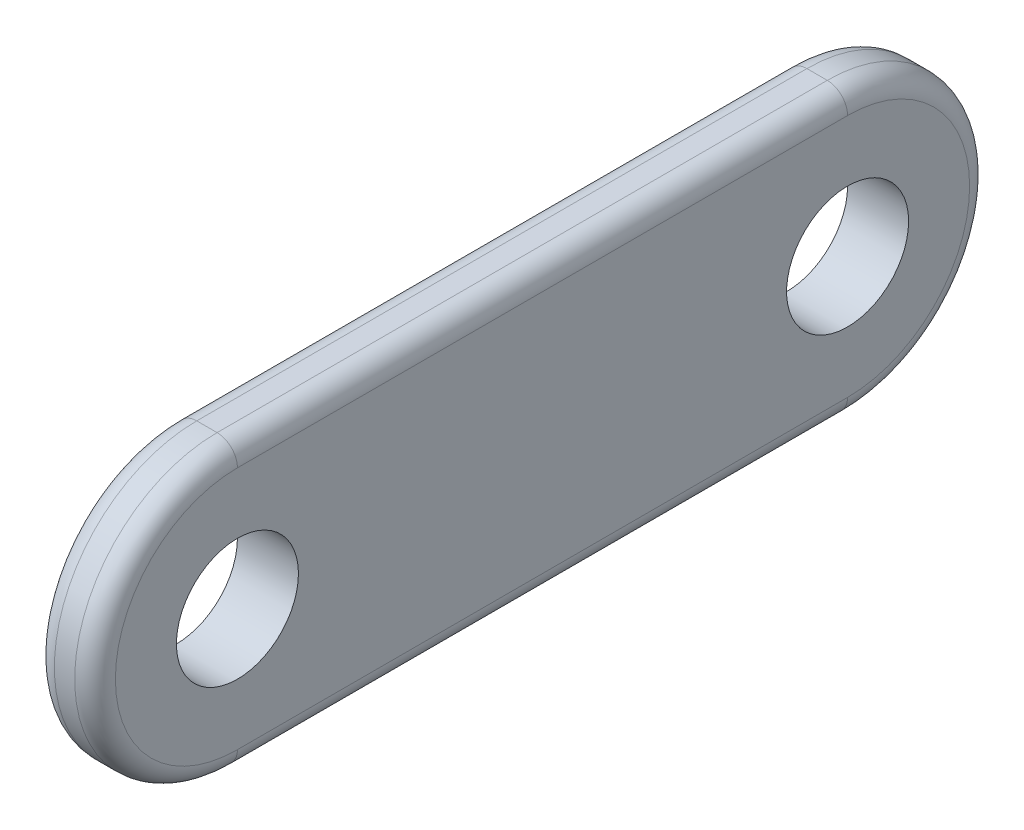
ISO-10303-21;
HEADER;
FILE_DESCRIPTION(('STEP AP214'),'2;1');
FILE_NAME('part.step','',(''),(''),'','','');
FILE_SCHEMA(('AUTOMOTIVE_DESIGN { 1 0 10303 214 1 1 1 1 }'));
ENDSEC;
DATA;
#1=APPLICATION_CONTEXT('core data for automotive mechanical design processes');
#2=APPLICATION_PROTOCOL_DEFINITION('international standard','automotive_design',2000,#1);
#3=PRODUCT_CONTEXT('',#1,'mechanical');
#4=PRODUCT('Part','Part','',(#3));
#5=PRODUCT_RELATED_PRODUCT_CATEGORY('part','',(#4));
#6=PRODUCT_DEFINITION_FORMATION('','',#4);
#7=PRODUCT_DEFINITION_CONTEXT('part definition',#1,'design');
#8=PRODUCT_DEFINITION('design','',#6,#7);
#9=PRODUCT_DEFINITION_SHAPE('','',#8);
#10=(LENGTH_UNIT() NAMED_UNIT(*) SI_UNIT(.MILLI.,.METRE.));
#11=(NAMED_UNIT(*) PLANE_ANGLE_UNIT() SI_UNIT($,.RADIAN.));
#12=(NAMED_UNIT(*) SI_UNIT($,.STERADIAN.) SOLID_ANGLE_UNIT());
#13=UNCERTAINTY_MEASURE_WITH_UNIT(LENGTH_MEASURE(1.E-05),#10,'distance_accuracy_value','');
#14=(GEOMETRIC_REPRESENTATION_CONTEXT(3) GLOBAL_UNCERTAINTY_ASSIGNED_CONTEXT((#13)) GLOBAL_UNIT_ASSIGNED_CONTEXT((#10,
#11,#12)) REPRESENTATION_CONTEXT('',''));
#15=CARTESIAN_POINT('',(0.,0.,0.));
#16=DIRECTION('',(0.,0.,1.));
#17=DIRECTION('',(1.,0.,0.));
#18=AXIS2_PLACEMENT_3D('',#15,#16,#17);
#19=CARTESIAN_POINT('',(3.,0.,15.));
#20=DIRECTION('',(1.,0.,0.));
#21=DIRECTION('',(0.,0.,-1.));
#22=AXIS2_PLACEMENT_3D('',#19,#20,#21);
#23=PLANE('',#22);
#24=CARTESIAN_POINT('',(3.,0.,-15.));
#25=DIRECTION('',(1.,0.,0.));
#26=DIRECTION('',(0.,0.,-1.));
#27=AXIS2_PLACEMENT_3D('',#24,#25,#26);
#28=CIRCLE('',#27,6.00000000000001);
#29=CARTESIAN_POINT('',(3.,-6.00000000000001,-15.));
#30=VERTEX_POINT('',#29);
#31=CARTESIAN_POINT('',(3.,6.00000000000001,-15.));
#32=VERTEX_POINT('',#31);
#33=EDGE_CURVE('E53',#30,#32,#28,.T.);
#34=ORIENTED_EDGE('',*,*,#33,.T.);
#35=DIRECTION('',(0.,0.,1.));
#36=VECTOR('',#35,1.);
#37=CARTESIAN_POINT('',(3.,6.00000000000001,15.));
#38=LINE('',#37,#36);
#39=CARTESIAN_POINT('',(3.,6.00000000000001,15.));
#40=VERTEX_POINT('',#39);
#41=EDGE_CURVE('E107',#32,#40,#38,.T.);
#42=ORIENTED_EDGE('',*,*,#41,.T.);
#43=CARTESIAN_POINT('',(3.,0.,15.));
#44=DIRECTION('',(1.,0.,0.));
#45=DIRECTION('',(0.,0.,-1.));
#46=AXIS2_PLACEMENT_3D('',#43,#44,#45);
#47=CIRCLE('',#46,6.00000000000001);
#48=CARTESIAN_POINT('',(3.,-6.00000000000001,15.));
#49=VERTEX_POINT('',#48);
#50=EDGE_CURVE('E159',#40,#49,#47,.T.);
#51=ORIENTED_EDGE('',*,*,#50,.T.);
#52=DIRECTION('',(0.,0.,-1.));
#53=VECTOR('',#52,1.);
#54=CARTESIAN_POINT('',(3.,-6.00000000000001,-15.));
#55=LINE('',#54,#53);
#56=EDGE_CURVE('E58',#49,#30,#55,.T.);
#57=ORIENTED_EDGE('',*,*,#56,.T.);
#58=EDGE_LOOP('',(#34,#42,#51,#57));
#59=FACE_BOUND('',#58,.T.);
#60=CARTESIAN_POINT('',(3.,0.,15.));
#61=DIRECTION('',(1.,0.,0.));
#62=DIRECTION('',(0.,0.,-1.));
#63=AXIS2_PLACEMENT_3D('',#60,#61,#62);
#64=CIRCLE('',#63,3.);
#65=CARTESIAN_POINT('',(3.,0.,12.));
#66=VERTEX_POINT('',#65);
#67=EDGE_CURVE('E135',#66,#66,#64,.T.);
#68=ORIENTED_EDGE('',*,*,#67,.F.);
#69=EDGE_LOOP('',(#68));
#70=FACE_BOUND('',#69,.T.);
#71=CARTESIAN_POINT('',(3.,0.,-15.));
#72=DIRECTION('',(1.,0.,0.));
#73=DIRECTION('',(0.,0.,-1.));
#74=AXIS2_PLACEMENT_3D('',#71,#72,#73);
#75=CIRCLE('',#74,3.);
#76=CARTESIAN_POINT('',(3.,0.,-18.));
#77=VERTEX_POINT('',#76);
#78=EDGE_CURVE('E346',#77,#77,#75,.T.);
#79=ORIENTED_EDGE('',*,*,#78,.F.);
#80=EDGE_LOOP('',(#79));
#81=FACE_BOUND('',#80,.T.);
#82=ADVANCED_FACE('F36',(#59,#70,#81),#23,.T.);
#83=CARTESIAN_POINT('',(0.,0.,15.));
#84=DIRECTION('',(1.,0.,0.));
#85=DIRECTION('',(0.,0.,-1.));
#86=AXIS2_PLACEMENT_3D('',#83,#84,#85);
#87=PLANE('',#86);
#88=DIRECTION('',(0.,0.,1.));
#89=VECTOR('',#88,1.);
#90=CARTESIAN_POINT('',(0.,6.00000000000001,15.));
#91=LINE('',#90,#89);
#92=CARTESIAN_POINT('',(0.,6.00000000000001,15.));
#93=VERTEX_POINT('',#92);
#94=CARTESIAN_POINT('',(0.,6.00000000000001,-15.));
#95=VERTEX_POINT('',#94);
#96=EDGE_CURVE('E142',#93,#95,#91,.F.);
#97=ORIENTED_EDGE('',*,*,#96,.T.);
#98=CARTESIAN_POINT('',(0.,0.,-15.));
#99=DIRECTION('',(1.,0.,0.));
#100=DIRECTION('',(0.,0.,-1.));
#101=AXIS2_PLACEMENT_3D('',#98,#99,#100);
#102=CIRCLE('',#101,6.00000000000001);
#103=CARTESIAN_POINT('',(0.,-6.00000000000001,-15.));
#104=VERTEX_POINT('',#103);
#105=EDGE_CURVE('E148',#95,#104,#102,.F.);
#106=ORIENTED_EDGE('',*,*,#105,.T.);
#107=DIRECTION('',(0.,0.,-1.));
#108=VECTOR('',#107,1.);
#109=CARTESIAN_POINT('',(0.,-6.00000000000001,15.));
#110=LINE('',#109,#108);
#111=CARTESIAN_POINT('',(0.,-6.00000000000001,15.));
#112=VERTEX_POINT('',#111);
#113=EDGE_CURVE('E146',#104,#112,#110,.F.);
#114=ORIENTED_EDGE('',*,*,#113,.T.);
#115=CARTESIAN_POINT('',(0.,0.,15.));
#116=DIRECTION('',(1.,0.,0.));
#117=DIRECTION('',(0.,0.,-1.));
#118=AXIS2_PLACEMENT_3D('',#115,#116,#117);
#119=CIRCLE('',#118,6.00000000000001);
#120=EDGE_CURVE('E144',#112,#93,#119,.F.);
#121=ORIENTED_EDGE('',*,*,#120,.T.);
#122=EDGE_LOOP('',(#97,#106,#114,#121));
#123=FACE_BOUND('',#122,.T.);
#124=CARTESIAN_POINT('',(0.,0.,15.));
#125=DIRECTION('',(1.,0.,0.));
#126=DIRECTION('',(0.,0.,-1.));
#127=AXIS2_PLACEMENT_3D('',#124,#125,#126);
#128=CIRCLE('',#127,3.);
#129=CARTESIAN_POINT('',(0.,0.,12.));
#130=VERTEX_POINT('',#129);
#131=EDGE_CURVE('E345',#130,#130,#128,.T.);
#132=ORIENTED_EDGE('',*,*,#131,.T.);
#133=EDGE_LOOP('',(#132));
#134=FACE_BOUND('',#133,.T.);
#135=CARTESIAN_POINT('',(0.,0.,-15.));
#136=DIRECTION('',(1.,0.,0.));
#137=DIRECTION('',(0.,0.,-1.));
#138=AXIS2_PLACEMENT_3D('',#135,#136,#137);
#139=CIRCLE('',#138,3.);
#140=CARTESIAN_POINT('',(0.,0.,-18.));
#141=VERTEX_POINT('',#140);
#142=EDGE_CURVE('E175',#141,#141,#139,.T.);
#143=ORIENTED_EDGE('',*,*,#142,.T.);
#144=EDGE_LOOP('',(#143));
#145=FACE_BOUND('',#144,.T.);
#146=ADVANCED_FACE('F203',(#123,#134,#145),#87,.F.);
#147=CARTESIAN_POINT('',(3.,0.,15.));
#148=DIRECTION('',(-1.,0.,0.));
#149=DIRECTION('',(0.,0.,1.));
#150=AXIS2_PLACEMENT_3D('',#147,#148,#149);
#151=CYLINDRICAL_SURFACE('',#150,7.00000000000001);
#152=DIRECTION('',(-1.,0.,0.));
#153=VECTOR('',#152,1.);
#154=CARTESIAN_POINT('',(3.,7.00000000000001,15.));
#155=LINE('',#154,#153);
#156=CARTESIAN_POINT('',(2.,7.00000000000001,15.));
#157=VERTEX_POINT('',#156);
#158=CARTESIAN_POINT('',(1.,7.00000000000001,15.));
#159=VERTEX_POINT('',#158);
#160=EDGE_CURVE('E128',#157,#159,#155,.T.);
#161=ORIENTED_EDGE('',*,*,#160,.T.);
#162=CARTESIAN_POINT('',(1.,0.,15.));
#163=DIRECTION('',(1.,0.,0.));
#164=DIRECTION('',(0.,0.,-1.));
#165=AXIS2_PLACEMENT_3D('',#162,#163,#164);
#166=CIRCLE('',#165,7.00000000000001);
#167=CARTESIAN_POINT('',(1.,-7.00000000000001,15.));
#168=VERTEX_POINT('',#167);
#169=EDGE_CURVE('E157',#159,#168,#166,.T.);
#170=ORIENTED_EDGE('',*,*,#169,.T.);
#171=DIRECTION('',(-1.,0.,0.));
#172=VECTOR('',#171,1.);
#173=CARTESIAN_POINT('',(3.,-7.00000000000001,15.));
#174=LINE('',#173,#172);
#175=CARTESIAN_POINT('',(2.,-7.00000000000001,15.));
#176=VERTEX_POINT('',#175);
#177=EDGE_CURVE('E120',#176,#168,#174,.T.);
#178=ORIENTED_EDGE('',*,*,#177,.F.);
#179=CARTESIAN_POINT('',(2.,0.,15.));
#180=DIRECTION('',(1.,0.,0.));
#181=DIRECTION('',(0.,0.,-1.));
#182=AXIS2_PLACEMENT_3D('',#179,#180,#181);
#183=CIRCLE('',#182,7.00000000000001);
#184=EDGE_CURVE('E155',#176,#157,#183,.F.);
#185=ORIENTED_EDGE('',*,*,#184,.T.);
#186=EDGE_LOOP('',(#161,#170,#178,#185));
#187=FACE_BOUND('',#186,.T.);
#188=ADVANCED_FACE('F189',(#187),#151,.T.);
#189=CARTESIAN_POINT('',(3.,-7.00000000000001,15.));
#190=DIRECTION('',(0.,1.,0.));
#191=DIRECTION('',(0.,0.,1.));
#192=AXIS2_PLACEMENT_3D('',#189,#190,#191);
#193=PLANE('',#192);
#194=ORIENTED_EDGE('',*,*,#177,.T.);
#195=DIRECTION('',(0.,0.,-1.));
#196=VECTOR('',#195,1.);
#197=CARTESIAN_POINT('',(1.,-7.00000000000001,15.));
#198=LINE('',#197,#196);
#199=CARTESIAN_POINT('',(1.,-7.00000000000001,-15.));
#200=VERTEX_POINT('',#199);
#201=EDGE_CURVE('E153',#168,#200,#198,.T.);
#202=ORIENTED_EDGE('',*,*,#201,.T.);
#203=DIRECTION('',(-1.,0.,0.));
#204=VECTOR('',#203,1.);
#205=CARTESIAN_POINT('',(3.,-7.00000000000001,-15.));
#206=LINE('',#205,#204);
#207=CARTESIAN_POINT('',(2.,-7.00000000000001,-15.));
#208=VERTEX_POINT('',#207);
#209=EDGE_CURVE('E132',#208,#200,#206,.T.);
#210=ORIENTED_EDGE('',*,*,#209,.F.);
#211=DIRECTION('',(0.,0.,-1.));
#212=VECTOR('',#211,1.);
#213=CARTESIAN_POINT('',(2.,-7.00000000000001,15.));
#214=LINE('',#213,#212);
#215=EDGE_CURVE('E151',#208,#176,#214,.F.);
#216=ORIENTED_EDGE('',*,*,#215,.T.);
#217=EDGE_LOOP('',(#194,#202,#210,#216));
#218=FACE_BOUND('',#217,.T.);
#219=ADVANCED_FACE('F186',(#218),#193,.F.);
#220=CARTESIAN_POINT('',(3.,0.,-15.));
#221=DIRECTION('',(-1.,0.,0.));
#222=DIRECTION('',(0.,0.,1.));
#223=AXIS2_PLACEMENT_3D('',#220,#221,#222);
#224=CYLINDRICAL_SURFACE('',#223,7.00000000000001);
#225=ORIENTED_EDGE('',*,*,#209,.T.);
#226=CARTESIAN_POINT('',(1.,0.,-15.));
#227=DIRECTION('',(1.,0.,0.));
#228=DIRECTION('',(0.,0.,-1.));
#229=AXIS2_PLACEMENT_3D('',#226,#227,#228);
#230=CIRCLE('',#229,7.00000000000001);
#231=CARTESIAN_POINT('',(1.,7.00000000000001,-15.));
#232=VERTEX_POINT('',#231);
#233=EDGE_CURVE('E119',#200,#232,#230,.T.);
#234=ORIENTED_EDGE('',*,*,#233,.T.);
#235=DIRECTION('',(-1.,0.,0.));
#236=VECTOR('',#235,1.);
#237=CARTESIAN_POINT('',(3.,7.00000000000001,-15.));
#238=LINE('',#237,#236);
#239=CARTESIAN_POINT('',(2.,7.00000000000001,-15.));
#240=VERTEX_POINT('',#239);
#241=EDGE_CURVE('E126',#240,#232,#238,.T.);
#242=ORIENTED_EDGE('',*,*,#241,.F.);
#243=CARTESIAN_POINT('',(2.,0.,-15.));
#244=DIRECTION('',(1.,0.,0.));
#245=DIRECTION('',(0.,0.,-1.));
#246=AXIS2_PLACEMENT_3D('',#243,#244,#245);
#247=CIRCLE('',#246,7.00000000000001);
#248=EDGE_CURVE('E113',#240,#208,#247,.F.);
#249=ORIENTED_EDGE('',*,*,#248,.T.);
#250=EDGE_LOOP('',(#225,#234,#242,#249));
#251=FACE_BOUND('',#250,.T.);
#252=ADVANCED_FACE('F130',(#251),#224,.T.);
#253=CARTESIAN_POINT('',(3.,7.00000000000001,15.));
#254=DIRECTION('',(0.,-1.,0.));
#255=DIRECTION('',(0.,0.,-1.));
#256=AXIS2_PLACEMENT_3D('',#253,#254,#255);
#257=PLANE('',#256);
#258=ORIENTED_EDGE('',*,*,#160,.F.);
#259=DIRECTION('',(0.,0.,1.));
#260=VECTOR('',#259,1.);
#261=CARTESIAN_POINT('',(2.,7.00000000000001,-15.));
#262=LINE('',#261,#260);
#263=EDGE_CURVE('E11',#157,#240,#262,.F.);
#264=ORIENTED_EDGE('',*,*,#263,.T.);
#265=ORIENTED_EDGE('',*,*,#241,.T.);
#266=DIRECTION('',(0.,0.,1.));
#267=VECTOR('',#266,1.);
#268=CARTESIAN_POINT('',(1.,7.00000000000001,15.));
#269=LINE('',#268,#267);
#270=EDGE_CURVE('E45',#232,#159,#269,.T.);
#271=ORIENTED_EDGE('',*,*,#270,.T.);
#272=EDGE_LOOP('',(#258,#264,#265,#271));
#273=FACE_BOUND('',#272,.T.);
#274=ADVANCED_FACE('F125',(#273),#257,.F.);
#275=CARTESIAN_POINT('',(3.,0.,15.));
#276=DIRECTION('',(-1.,0.,0.));
#277=DIRECTION('',(0.,0.,1.));
#278=AXIS2_PLACEMENT_3D('',#275,#276,#277);
#279=CYLINDRICAL_SURFACE('',#278,3.);
#280=ORIENTED_EDGE('',*,*,#67,.T.);
#281=EDGE_LOOP('',(#280));
#282=FACE_BOUND('',#281,.T.);
#283=ORIENTED_EDGE('',*,*,#131,.F.);
#284=EDGE_LOOP('',(#283));
#285=FACE_BOUND('',#284,.T.);
#286=ADVANCED_FACE('F228',(#282,#285),#279,.F.);
#287=CARTESIAN_POINT('',(3.,0.,-15.));
#288=DIRECTION('',(-1.,0.,0.));
#289=DIRECTION('',(0.,0.,1.));
#290=AXIS2_PLACEMENT_3D('',#287,#288,#289);
#291=CYLINDRICAL_SURFACE('',#290,3.);
#292=ORIENTED_EDGE('',*,*,#78,.T.);
#293=EDGE_LOOP('',(#292));
#294=FACE_BOUND('',#293,.T.);
#295=ORIENTED_EDGE('',*,*,#142,.F.);
#296=EDGE_LOOP('',(#295));
#297=FACE_BOUND('',#296,.T.);
#298=ADVANCED_FACE('F218',(#294,#297),#291,.F.);
#299=CARTESIAN_POINT('',(1.,0.,15.));
#300=DIRECTION('',(1.,0.,0.));
#301=DIRECTION('',(0.,0.,-1.));
#302=AXIS2_PLACEMENT_3D('',#299,#300,#301);
#303=TOROIDAL_SURFACE('',#302,6.00000000000001,1.);
#304=CARTESIAN_POINT('',(1.,6.00000000000001,15.));
#305=DIRECTION('',(0.,0.,-1.));
#306=DIRECTION('',(-1.,0.,0.));
#307=AXIS2_PLACEMENT_3D('',#304,#305,#306);
#308=CIRCLE('',#307,1.);
#309=EDGE_CURVE('E169',#93,#159,#308,.T.);
#310=ORIENTED_EDGE('',*,*,#309,.F.);
#311=ORIENTED_EDGE('',*,*,#120,.F.);
#312=CARTESIAN_POINT('',(1.,-6.00000000000001,15.));
#313=DIRECTION('',(0.,0.,-1.));
#314=DIRECTION('',(-1.,0.,0.));
#315=AXIS2_PLACEMENT_3D('',#312,#313,#314);
#316=CIRCLE('',#315,1.);
#317=EDGE_CURVE('E172',#168,#112,#316,.T.);
#318=ORIENTED_EDGE('',*,*,#317,.F.);
#319=ORIENTED_EDGE('',*,*,#169,.F.);
#320=EDGE_LOOP('',(#310,#311,#318,#319));
#321=FACE_BOUND('',#320,.T.);
#322=ADVANCED_FACE('F193',(#321),#303,.T.);
#323=CARTESIAN_POINT('',(1.,-6.00000000000001,15.));
#324=DIRECTION('',(0.,0.,-1.));
#325=DIRECTION('',(-1.,0.,0.));
#326=AXIS2_PLACEMENT_3D('',#323,#324,#325);
#327=CYLINDRICAL_SURFACE('',#326,1.);
#328=ORIENTED_EDGE('',*,*,#317,.T.);
#329=ORIENTED_EDGE('',*,*,#113,.F.);
#330=CARTESIAN_POINT('',(1.,-6.00000000000001,-15.));
#331=DIRECTION('',(0.,0.,-1.));
#332=DIRECTION('',(-1.,0.,0.));
#333=AXIS2_PLACEMENT_3D('',#330,#331,#332);
#334=CIRCLE('',#333,1.);
#335=EDGE_CURVE('E167',#200,#104,#334,.T.);
#336=ORIENTED_EDGE('',*,*,#335,.F.);
#337=ORIENTED_EDGE('',*,*,#201,.F.);
#338=EDGE_LOOP('',(#328,#329,#336,#337));
#339=FACE_BOUND('',#338,.T.);
#340=ADVANCED_FACE('F210',(#339),#327,.T.);
#341=CARTESIAN_POINT('',(1.,6.00000000000001,15.));
#342=DIRECTION('',(0.,0.,1.));
#343=DIRECTION('',(0.,-1.,0.));
#344=AXIS2_PLACEMENT_3D('',#341,#342,#343);
#345=CYLINDRICAL_SURFACE('',#344,1.);
#346=ORIENTED_EDGE('',*,*,#309,.T.);
#347=ORIENTED_EDGE('',*,*,#270,.F.);
#348=CARTESIAN_POINT('',(1.,6.00000000000001,-15.));
#349=DIRECTION('',(0.,0.,-1.));
#350=DIRECTION('',(-1.,0.,0.));
#351=AXIS2_PLACEMENT_3D('',#348,#349,#350);
#352=CIRCLE('',#351,1.);
#353=EDGE_CURVE('E165',#95,#232,#352,.T.);
#354=ORIENTED_EDGE('',*,*,#353,.F.);
#355=ORIENTED_EDGE('',*,*,#96,.F.);
#356=EDGE_LOOP('',(#346,#347,#354,#355));
#357=FACE_BOUND('',#356,.T.);
#358=ADVANCED_FACE('F199',(#357),#345,.T.);
#359=CARTESIAN_POINT('',(1.,0.,-15.));
#360=DIRECTION('',(1.,0.,0.));
#361=DIRECTION('',(0.,0.,-1.));
#362=AXIS2_PLACEMENT_3D('',#359,#360,#361);
#363=TOROIDAL_SURFACE('',#362,6.00000000000001,1.);
#364=ORIENTED_EDGE('',*,*,#335,.T.);
#365=ORIENTED_EDGE('',*,*,#105,.F.);
#366=ORIENTED_EDGE('',*,*,#353,.T.);
#367=ORIENTED_EDGE('',*,*,#233,.F.);
#368=EDGE_LOOP('',(#364,#365,#366,#367));
#369=FACE_BOUND('',#368,.T.);
#370=ADVANCED_FACE('F206',(#369),#363,.T.);
#371=CARTESIAN_POINT('',(2.,-6.00000000000001,15.));
#372=DIRECTION('',(0.,0.,1.));
#373=DIRECTION('',(1.,0.,0.));
#374=AXIS2_PLACEMENT_3D('',#371,#372,#373);
#375=CYLINDRICAL_SURFACE('',#374,1.);
#376=CARTESIAN_POINT('',(2.,-6.00000000000001,15.));
#377=DIRECTION('',(0.,0.,1.));
#378=DIRECTION('',(1.,0.,0.));
#379=AXIS2_PLACEMENT_3D('',#376,#377,#378);
#380=CIRCLE('',#379,1.);
#381=EDGE_CURVE('E109',#176,#49,#380,.T.);
#382=ORIENTED_EDGE('',*,*,#381,.F.);
#383=ORIENTED_EDGE('',*,*,#215,.F.);
#384=CARTESIAN_POINT('',(2.,-6.00000000000001,-15.));
#385=DIRECTION('',(0.,0.,-1.));
#386=DIRECTION('',(-1.,0.,0.));
#387=AXIS2_PLACEMENT_3D('',#384,#385,#386);
#388=CIRCLE('',#387,1.);
#389=EDGE_CURVE('E40',#30,#208,#388,.T.);
#390=ORIENTED_EDGE('',*,*,#389,.F.);
#391=ORIENTED_EDGE('',*,*,#56,.F.);
#392=EDGE_LOOP('',(#382,#383,#390,#391));
#393=FACE_BOUND('',#392,.T.);
#394=ADVANCED_FACE('F38',(#393),#375,.T.);
#395=CARTESIAN_POINT('',(2.,0.,-15.));
#396=DIRECTION('',(1.,0.,0.));
#397=DIRECTION('',(0.,0.,-1.));
#398=AXIS2_PLACEMENT_3D('',#395,#396,#397);
#399=TOROIDAL_SURFACE('',#398,6.00000000000001,1.);
#400=ORIENTED_EDGE('',*,*,#389,.T.);
#401=ORIENTED_EDGE('',*,*,#248,.F.);
#402=CARTESIAN_POINT('',(2.,6.00000000000001,-15.));
#403=DIRECTION('',(0.,0.,1.));
#404=DIRECTION('',(1.,0.,0.));
#405=AXIS2_PLACEMENT_3D('',#402,#403,#404);
#406=CIRCLE('',#405,1.);
#407=EDGE_CURVE('E103',#32,#240,#406,.T.);
#408=ORIENTED_EDGE('',*,*,#407,.F.);
#409=ORIENTED_EDGE('',*,*,#33,.F.);
#410=EDGE_LOOP('',(#400,#401,#408,#409));
#411=FACE_BOUND('',#410,.T.);
#412=ADVANCED_FACE('F114',(#411),#399,.T.);
#413=CARTESIAN_POINT('',(2.,0.,15.));
#414=DIRECTION('',(1.,0.,0.));
#415=DIRECTION('',(0.,0.,-1.));
#416=AXIS2_PLACEMENT_3D('',#413,#414,#415);
#417=TOROIDAL_SURFACE('',#416,6.00000000000001,1.);
#418=ORIENTED_EDGE('',*,*,#381,.T.);
#419=ORIENTED_EDGE('',*,*,#50,.F.);
#420=CARTESIAN_POINT('',(2.,6.00000000000001,15.));
#421=DIRECTION('',(0.,0.,-1.));
#422=DIRECTION('',(-1.,0.,0.));
#423=AXIS2_PLACEMENT_3D('',#420,#421,#422);
#424=CIRCLE('',#423,1.);
#425=EDGE_CURVE('E110',#157,#40,#424,.T.);
#426=ORIENTED_EDGE('',*,*,#425,.F.);
#427=ORIENTED_EDGE('',*,*,#184,.F.);
#428=EDGE_LOOP('',(#418,#419,#426,#427));
#429=FACE_BOUND('',#428,.T.);
#430=ADVANCED_FACE('F181',(#429),#417,.T.);
#431=CARTESIAN_POINT('',(2.,6.00000000000001,15.));
#432=DIRECTION('',(0.,0.,-1.));
#433=DIRECTION('',(0.,1.,0.));
#434=AXIS2_PLACEMENT_3D('',#431,#432,#433);
#435=CYLINDRICAL_SURFACE('',#434,1.);
#436=ORIENTED_EDGE('',*,*,#407,.T.);
#437=ORIENTED_EDGE('',*,*,#263,.F.);
#438=ORIENTED_EDGE('',*,*,#425,.T.);
#439=ORIENTED_EDGE('',*,*,#41,.F.);
#440=EDGE_LOOP('',(#436,#437,#438,#439));
#441=FACE_BOUND('',#440,.T.);
#442=ADVANCED_FACE('F105',(#441),#435,.T.);
#443=CLOSED_SHELL('',(#82,#146,#188,#219,#252,#274,#286,#298,#322,#340,#358,#370,#394,#412,#430,#442));
#444=MANIFOLD_SOLID_BREP('B2',#443);
#445=ADVANCED_BREP_SHAPE_REPRESENTATION('',(#18,#444),#14);
#446=SHAPE_DEFINITION_REPRESENTATION(#9,#445);
ENDSEC;
END-ISO-10303-21;
